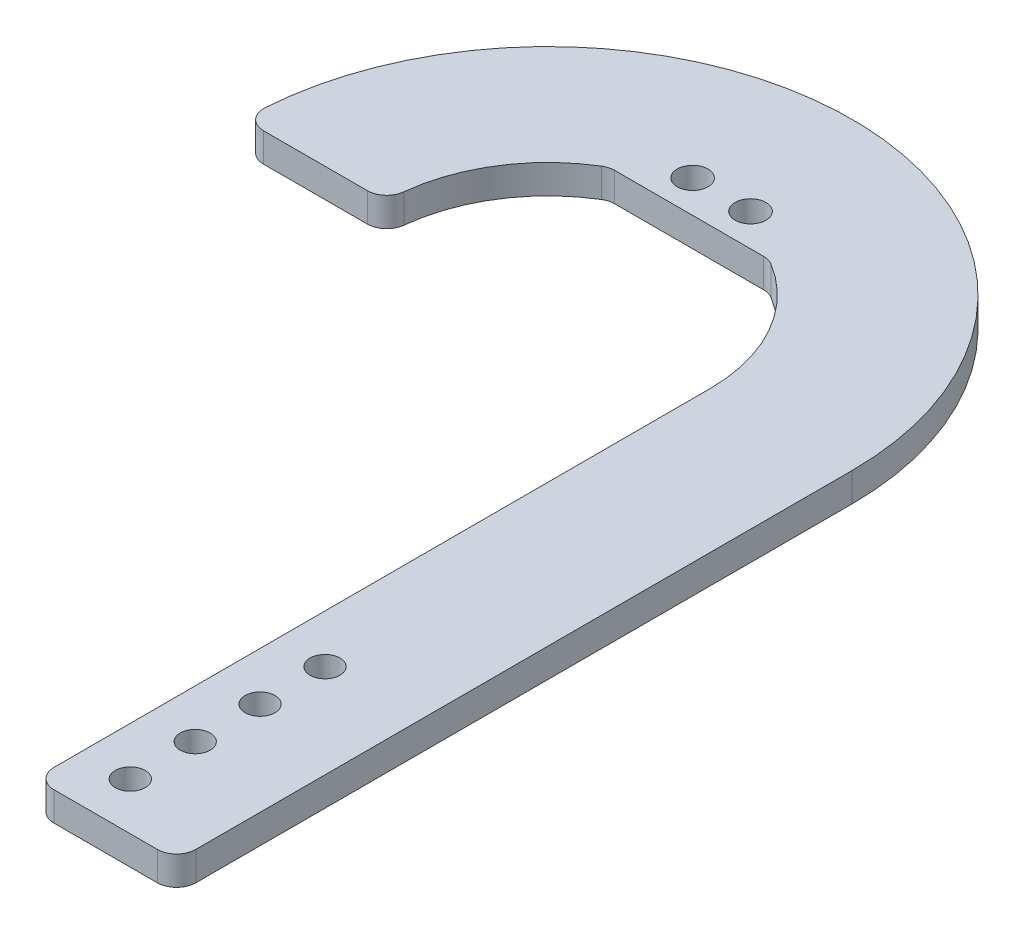
ISO-10303-21;
HEADER;
FILE_DESCRIPTION(('STEP AP214'),'2;1');
FILE_NAME('part.step','',(''),(''),'','','');
FILE_SCHEMA(('AUTOMOTIVE_DESIGN { 1 0 10303 214 1 1 1 1 }'));
ENDSEC;
DATA;
#1=APPLICATION_CONTEXT('core data for automotive mechanical design processes');
#2=APPLICATION_PROTOCOL_DEFINITION('international standard','automotive_design',2000,#1);
#3=PRODUCT_CONTEXT('',#1,'mechanical');
#4=PRODUCT('Part','Part','',(#3));
#5=PRODUCT_RELATED_PRODUCT_CATEGORY('part','',(#4));
#6=PRODUCT_DEFINITION_FORMATION('','',#4);
#7=PRODUCT_DEFINITION_CONTEXT('part definition',#1,'design');
#8=PRODUCT_DEFINITION('design','',#6,#7);
#9=PRODUCT_DEFINITION_SHAPE('','',#8);
#10=(LENGTH_UNIT() NAMED_UNIT(*) SI_UNIT(.MILLI.,.METRE.));
#11=(NAMED_UNIT(*) PLANE_ANGLE_UNIT() SI_UNIT($,.RADIAN.));
#12=(NAMED_UNIT(*) SI_UNIT($,.STERADIAN.) SOLID_ANGLE_UNIT());
#13=UNCERTAINTY_MEASURE_WITH_UNIT(LENGTH_MEASURE(1.E-05),#10,'distance_accuracy_value','');
#14=(GEOMETRIC_REPRESENTATION_CONTEXT(3) GLOBAL_UNCERTAINTY_ASSIGNED_CONTEXT((#13)) GLOBAL_UNIT_ASSIGNED_CONTEXT((#10,
#11,#12)) REPRESENTATION_CONTEXT('',''));
#15=CARTESIAN_POINT('',(0.,0.,0.));
#16=DIRECTION('',(0.,0.,1.));
#17=DIRECTION('',(1.,0.,0.));
#18=AXIS2_PLACEMENT_3D('',#15,#16,#17);
#19=CARTESIAN_POINT('',(0.,3.,0.));
#20=DIRECTION('',(0.,-1.,0.));
#21=DIRECTION('',(0.,0.,-1.));
#22=AXIS2_PLACEMENT_3D('',#19,#20,#21);
#23=CYLINDRICAL_SURFACE('',#22,16.8134);
#24=CARTESIAN_POINT('',(0.,0.,0.));
#25=DIRECTION('',(0.,1.,0.));
#26=DIRECTION('',(0.,0.,1.));
#27=AXIS2_PLACEMENT_3D('',#24,#25,#26);
#28=CIRCLE('',#27,16.8134);
#29=CARTESIAN_POINT('',(-8.77269581239082,0.,-14.3432990536787));
#30=VERTEX_POINT('',#29);
#31=CARTESIAN_POINT('',(-16.7181240671271,0.,-1.78738558686893));
#32=VERTEX_POINT('',#31);
#33=EDGE_CURVE('E254',#30,#32,#28,.T.);
#34=ORIENTED_EDGE('',*,*,#33,.F.);
#35=DIRECTION('',(0.,-1.,0.));
#36=VECTOR('',#35,1.);
#37=CARTESIAN_POINT('',(-8.77269581239082,3.,-14.3432990536787));
#38=LINE('',#37,#36);
#39=CARTESIAN_POINT('',(-8.77269581239082,3.,-14.3432990536787));
#40=VERTEX_POINT('',#39);
#41=EDGE_CURVE('E204',#30,#40,#38,.F.);
#42=ORIENTED_EDGE('',*,*,#41,.T.);
#43=CARTESIAN_POINT('',(0.,3.,0.));
#44=DIRECTION('',(0.,1.,0.));
#45=DIRECTION('',(0.,0.,1.));
#46=AXIS2_PLACEMENT_3D('',#43,#44,#45);
#47=CIRCLE('',#46,16.8134);
#48=CARTESIAN_POINT('',(-16.7181240671271,3.,-1.78738558686893));
#49=VERTEX_POINT('',#48);
#50=EDGE_CURVE('E173',#40,#49,#47,.T.);
#51=ORIENTED_EDGE('',*,*,#50,.T.);
#52=DIRECTION('',(0.,-1.,0.));
#53=VECTOR('',#52,1.);
#54=CARTESIAN_POINT('',(-16.7181240671271,3.,-1.78738558686893));
#55=LINE('',#54,#53);
#56=EDGE_CURVE('E202',#49,#32,#55,.T.);
#57=ORIENTED_EDGE('',*,*,#56,.T.);
#58=EDGE_LOOP('',(#34,#42,#51,#57));
#59=FACE_BOUND('',#58,.T.);
#60=ADVANCED_FACE('F41',(#59),#23,.F.);
#61=CARTESIAN_POINT('',(0.,3.,-14.6371243295089));
#62=DIRECTION('',(0.,0.,-1.));
#63=DIRECTION('',(-1.,0.,0.));
#64=AXIS2_PLACEMENT_3D('',#61,#62,#63);
#65=PLANE('',#64);
#66=DIRECTION('',(1.,0.,0.));
#67=VECTOR('',#66,1.);
#68=CARTESIAN_POINT('',(0.,3.,-14.6371243295089));
#69=LINE('',#68,#67);
#70=CARTESIAN_POINT('',(-7.72915960765046,3.,-14.6371243295089));
#71=VERTEX_POINT('',#70);
#72=CARTESIAN_POINT('',(7.72915960765046,3.,-14.6371243295089));
#73=VERTEX_POINT('',#72);
#74=EDGE_CURVE('E171',#71,#73,#69,.T.);
#75=ORIENTED_EDGE('',*,*,#74,.F.);
#76=DIRECTION('',(0.,-1.,0.));
#77=VECTOR('',#76,1.);
#78=CARTESIAN_POINT('',(-7.72915960765046,3.,-14.6371243295089));
#79=LINE('',#78,#77);
#80=CARTESIAN_POINT('',(-7.72915960765046,0.,-14.6371243295089));
#81=VERTEX_POINT('',#80);
#82=EDGE_CURVE('E199',#71,#81,#79,.T.);
#83=ORIENTED_EDGE('',*,*,#82,.T.);
#84=DIRECTION('',(1.,0.,0.));
#85=VECTOR('',#84,1.);
#86=CARTESIAN_POINT('',(0.,0.,-14.6371243295089));
#87=LINE('',#86,#85);
#88=CARTESIAN_POINT('',(7.72915960765046,0.,-14.6371243295089));
#89=VERTEX_POINT('',#88);
#90=EDGE_CURVE('E247',#81,#89,#87,.T.);
#91=ORIENTED_EDGE('',*,*,#90,.T.);
#92=DIRECTION('',(0.,-1.,0.));
#93=VECTOR('',#92,1.);
#94=CARTESIAN_POINT('',(7.72915960765046,3.,-14.6371243295089));
#95=LINE('',#94,#93);
#96=EDGE_CURVE('E163',#89,#73,#95,.F.);
#97=ORIENTED_EDGE('',*,*,#96,.T.);
#98=EDGE_LOOP('',(#75,#83,#91,#97));
#99=FACE_BOUND('',#98,.T.);
#100=ADVANCED_FACE('F252',(#99),#65,.F.);
#101=CARTESIAN_POINT('',(16.8134,3.,0.));
#102=VERTEX_POINT('',#101);
#103=CARTESIAN_POINT('',(8.77269581239082,3.,-14.3432990536787));
#104=VERTEX_POINT('',#103);
#105=EDGE_CURVE('E154',#102,#104,#47,.T.);
#106=ORIENTED_EDGE('',*,*,#105,.T.);
#107=DIRECTION('',(0.,-1.,0.));
#108=VECTOR('',#107,1.);
#109=CARTESIAN_POINT('',(8.77269581239082,3.,-14.3432990536787));
#110=LINE('',#109,#108);
#111=CARTESIAN_POINT('',(8.77269581239082,0.,-14.3432990536787));
#112=VERTEX_POINT('',#111);
#113=EDGE_CURVE('E206',#104,#112,#110,.T.);
#114=ORIENTED_EDGE('',*,*,#113,.T.);
#115=CARTESIAN_POINT('',(16.8134,0.,0.));
#116=VERTEX_POINT('',#115);
#117=EDGE_CURVE('E162',#116,#112,#28,.T.);
#118=ORIENTED_EDGE('',*,*,#117,.F.);
#119=DIRECTION('',(0.,-1.,0.));
#120=VECTOR('',#119,1.);
#121=CARTESIAN_POINT('',(16.8134,3.,0.));
#122=LINE('',#121,#120);
#123=EDGE_CURVE('E147',#102,#116,#122,.T.);
#124=ORIENTED_EDGE('',*,*,#123,.F.);
#125=EDGE_LOOP('',(#106,#114,#118,#124));
#126=FACE_BOUND('',#125,.T.);
#127=ADVANCED_FACE('F158',(#126),#23,.F.);
#128=CARTESIAN_POINT('',(16.8134,3.,0.));
#129=DIRECTION('',(-1.,0.,0.));
#130=DIRECTION('',(0.,0.,1.));
#131=AXIS2_PLACEMENT_3D('',#128,#129,#130);
#132=PLANE('',#131);
#133=DIRECTION('',(0.,0.,-1.));
#134=VECTOR('',#133,1.);
#135=CARTESIAN_POINT('',(16.8134,0.,0.));
#136=LINE('',#135,#134);
#137=CARTESIAN_POINT('',(16.8134,0.,68.));
#138=VERTEX_POINT('',#137);
#139=EDGE_CURVE('E415',#138,#116,#136,.T.);
#140=ORIENTED_EDGE('',*,*,#139,.F.);
#141=DIRECTION('',(0.,-1.,0.));
#142=VECTOR('',#141,1.);
#143=CARTESIAN_POINT('',(16.8134,3.,68.));
#144=LINE('',#143,#142);
#145=CARTESIAN_POINT('',(16.8134,3.,68.));
#146=VERTEX_POINT('',#145);
#147=EDGE_CURVE('E150',#138,#146,#144,.F.);
#148=ORIENTED_EDGE('',*,*,#147,.T.);
#149=DIRECTION('',(0.,0.,-1.));
#150=VECTOR('',#149,1.);
#151=CARTESIAN_POINT('',(16.8134,3.,0.));
#152=LINE('',#151,#150);
#153=EDGE_CURVE('E143',#146,#102,#152,.T.);
#154=ORIENTED_EDGE('',*,*,#153,.T.);
#155=ORIENTED_EDGE('',*,*,#123,.T.);
#156=EDGE_LOOP('',(#140,#148,#154,#155));
#157=FACE_BOUND('',#156,.T.);
#158=ADVANCED_FACE('F146',(#157),#132,.T.);
#159=CARTESIAN_POINT('',(0.,3.,70.));
#160=DIRECTION('',(0.,0.,-1.));
#161=DIRECTION('',(-1.,0.,0.));
#162=AXIS2_PLACEMENT_3D('',#159,#160,#161);
#163=PLANE('',#162);
#164=DIRECTION('',(1.,0.,0.));
#165=VECTOR('',#164,1.);
#166=CARTESIAN_POINT('',(0.,0.,70.));
#167=LINE('',#166,#165);
#168=CARTESIAN_POINT('',(18.8134,0.,70.));
#169=VERTEX_POINT('',#168);
#170=CARTESIAN_POINT('',(29.5228,0.,70.));
#171=VERTEX_POINT('',#170);
#172=EDGE_CURVE('E412',#169,#171,#167,.T.);
#173=ORIENTED_EDGE('',*,*,#172,.T.);
#174=DIRECTION('',(0.,-1.,0.));
#175=VECTOR('',#174,1.);
#176=CARTESIAN_POINT('',(29.5228,3.,70.));
#177=LINE('',#176,#175);
#178=CARTESIAN_POINT('',(29.5228,3.,70.));
#179=VERTEX_POINT('',#178);
#180=EDGE_CURVE('E222',#171,#179,#177,.F.);
#181=ORIENTED_EDGE('',*,*,#180,.T.);
#182=DIRECTION('',(1.,0.,0.));
#183=VECTOR('',#182,1.);
#184=CARTESIAN_POINT('',(0.,3.,70.));
#185=LINE('',#184,#183);
#186=CARTESIAN_POINT('',(18.8134,3.,70.));
#187=VERTEX_POINT('',#186);
#188=EDGE_CURVE('E153',#187,#179,#185,.T.);
#189=ORIENTED_EDGE('',*,*,#188,.F.);
#190=DIRECTION('',(0.,-1.,0.));
#191=VECTOR('',#190,1.);
#192=CARTESIAN_POINT('',(18.8134,0.,70.));
#193=LINE('',#192,#191);
#194=EDGE_CURVE('E219',#187,#169,#193,.T.);
#195=ORIENTED_EDGE('',*,*,#194,.T.);
#196=EDGE_LOOP('',(#173,#181,#189,#195));
#197=FACE_BOUND('',#196,.T.);
#198=ADVANCED_FACE('F283',(#197),#163,.F.);
#199=CARTESIAN_POINT('',(31.5228,3.,0.));
#200=DIRECTION('',(1.,0.,0.));
#201=DIRECTION('',(0.,0.,-1.));
#202=AXIS2_PLACEMENT_3D('',#199,#200,#201);
#203=PLANE('',#202);
#204=DIRECTION('',(0.,0.,1.));
#205=VECTOR('',#204,1.);
#206=CARTESIAN_POINT('',(31.5228,3.,0.));
#207=LINE('',#206,#205);
#208=CARTESIAN_POINT('',(31.5228,3.,0.));
#209=VERTEX_POINT('',#208);
#210=CARTESIAN_POINT('',(31.5228,3.,68.));
#211=VERTEX_POINT('',#210);
#212=EDGE_CURVE('E438',#209,#211,#207,.T.);
#213=ORIENTED_EDGE('',*,*,#212,.T.);
#214=DIRECTION('',(0.,-1.,0.));
#215=VECTOR('',#214,1.);
#216=CARTESIAN_POINT('',(31.5228,0.,68.));
#217=LINE('',#216,#215);
#218=CARTESIAN_POINT('',(31.5228,0.,68.));
#219=VERTEX_POINT('',#218);
#220=EDGE_CURVE('E208',#211,#219,#217,.T.);
#221=ORIENTED_EDGE('',*,*,#220,.T.);
#222=DIRECTION('',(0.,0.,1.));
#223=VECTOR('',#222,1.);
#224=CARTESIAN_POINT('',(31.5228,0.,0.));
#225=LINE('',#224,#223);
#226=CARTESIAN_POINT('',(31.5228,0.,0.));
#227=VERTEX_POINT('',#226);
#228=EDGE_CURVE('E396',#227,#219,#225,.T.);
#229=ORIENTED_EDGE('',*,*,#228,.F.);
#230=DIRECTION('',(0.,-1.,0.));
#231=VECTOR('',#230,1.);
#232=CARTESIAN_POINT('',(31.5228,3.,0.));
#233=LINE('',#232,#231);
#234=EDGE_CURVE('E164',#209,#227,#233,.T.);
#235=ORIENTED_EDGE('',*,*,#234,.F.);
#236=EDGE_LOOP('',(#213,#221,#229,#235));
#237=FACE_BOUND('',#236,.T.);
#238=ADVANCED_FACE('F287',(#237),#203,.T.);
#239=CARTESIAN_POINT('',(0.,3.,0.));
#240=DIRECTION('',(0.,-1.,0.));
#241=DIRECTION('',(0.,0.,-1.));
#242=AXIS2_PLACEMENT_3D('',#239,#240,#241);
#243=CYLINDRICAL_SURFACE('',#242,31.5228);
#244=CARTESIAN_POINT('',(0.,0.,0.));
#245=DIRECTION('',(0.,1.,0.));
#246=DIRECTION('',(0.,0.,1.));
#247=AXIS2_PLACEMENT_3D('',#244,#245,#246);
#248=CIRCLE('',#247,31.5228);
#249=CARTESIAN_POINT('',(-31.4503832836761,0.,-2.13548850380045));
#250=VERTEX_POINT('',#249);
#251=EDGE_CURVE('E391',#227,#250,#248,.T.);
#252=ORIENTED_EDGE('',*,*,#251,.T.);
#253=DIRECTION('',(0.,-1.,0.));
#254=VECTOR('',#253,1.);
#255=CARTESIAN_POINT('',(-31.4503832836761,3.,-2.13548850380045));
#256=LINE('',#255,#254);
#257=CARTESIAN_POINT('',(-31.4503832836761,3.,-2.13548850380045));
#258=VERTEX_POINT('',#257);
#259=EDGE_CURVE('E236',#250,#258,#256,.F.);
#260=ORIENTED_EDGE('',*,*,#259,.T.);
#261=CARTESIAN_POINT('',(0.,3.,0.));
#262=DIRECTION('',(0.,1.,0.));
#263=DIRECTION('',(0.,0.,1.));
#264=AXIS2_PLACEMENT_3D('',#261,#262,#263);
#265=CIRCLE('',#264,31.5228);
#266=EDGE_CURVE('E436',#209,#258,#265,.T.);
#267=ORIENTED_EDGE('',*,*,#266,.F.);
#268=ORIENTED_EDGE('',*,*,#234,.T.);
#269=EDGE_LOOP('',(#252,#260,#267,#268));
#270=FACE_BOUND('',#269,.T.);
#271=ADVANCED_FACE('F293',(#270),#243,.T.);
#272=CARTESIAN_POINT('',(21.8134,3.,58.3629));
#273=DIRECTION('',(0.,-1.,0.));
#274=DIRECTION('',(0.,0.,-1.));
#275=AXIS2_PLACEMENT_3D('',#272,#273,#274);
#276=CYLINDRICAL_SURFACE('',#275,1.55);
#277=CARTESIAN_POINT('',(21.8134,3.,58.3629));
#278=DIRECTION('',(0.,1.,0.));
#279=DIRECTION('',(0.,0.,1.));
#280=AXIS2_PLACEMENT_3D('',#277,#278,#279);
#281=CIRCLE('',#280,1.55);
#282=CARTESIAN_POINT('',(21.8134,3.,59.9129));
#283=VERTEX_POINT('',#282);
#284=EDGE_CURVE('E423',#283,#283,#281,.T.);
#285=ORIENTED_EDGE('',*,*,#284,.T.);
#286=EDGE_LOOP('',(#285));
#287=FACE_BOUND('',#286,.T.);
#288=CARTESIAN_POINT('',(21.8134,0.,58.3629));
#289=DIRECTION('',(0.,1.,0.));
#290=DIRECTION('',(0.,0.,1.));
#291=AXIS2_PLACEMENT_3D('',#288,#289,#290);
#292=CIRCLE('',#291,1.55);
#293=CARTESIAN_POINT('',(21.8134,0.,59.9129));
#294=VERTEX_POINT('',#293);
#295=EDGE_CURVE('E187',#294,#294,#292,.T.);
#296=ORIENTED_EDGE('',*,*,#295,.F.);
#297=EDGE_LOOP('',(#296));
#298=FACE_BOUND('',#297,.T.);
#299=ADVANCED_FACE('F297',(#287,#298),#276,.F.);
#300=CARTESIAN_POINT('',(-3.,3.,-18.));
#301=DIRECTION('',(0.,-1.,0.));
#302=DIRECTION('',(0.,0.,-1.));
#303=AXIS2_PLACEMENT_3D('',#300,#301,#302);
#304=CYLINDRICAL_SURFACE('',#303,1.6);
#305=CARTESIAN_POINT('',(-3.,3.,-18.));
#306=DIRECTION('',(0.,1.,0.));
#307=DIRECTION('',(0.,0.,1.));
#308=AXIS2_PLACEMENT_3D('',#305,#306,#307);
#309=CIRCLE('',#308,1.6);
#310=CARTESIAN_POINT('',(-3.,3.,-16.4));
#311=VERTEX_POINT('',#310);
#312=EDGE_CURVE('E426',#311,#311,#309,.T.);
#313=ORIENTED_EDGE('',*,*,#312,.T.);
#314=EDGE_LOOP('',(#313));
#315=FACE_BOUND('',#314,.T.);
#316=CARTESIAN_POINT('',(-3.,0.,-18.));
#317=DIRECTION('',(0.,1.,0.));
#318=DIRECTION('',(0.,0.,1.));
#319=AXIS2_PLACEMENT_3D('',#316,#317,#318);
#320=CIRCLE('',#319,1.6);
#321=CARTESIAN_POINT('',(-3.,0.,-16.4));
#322=VERTEX_POINT('',#321);
#323=EDGE_CURVE('E192',#322,#322,#320,.T.);
#324=ORIENTED_EDGE('',*,*,#323,.F.);
#325=EDGE_LOOP('',(#324));
#326=FACE_BOUND('',#325,.T.);
#327=ADVANCED_FACE('F310',(#315,#326),#304,.F.);
#328=CARTESIAN_POINT('',(21.8134,3.,51.6371));
#329=DIRECTION('',(0.,-1.,0.));
#330=DIRECTION('',(0.,0.,-1.));
#331=AXIS2_PLACEMENT_3D('',#328,#329,#330);
#332=CYLINDRICAL_SURFACE('',#331,1.55);
#333=CARTESIAN_POINT('',(21.8134,3.,51.6371));
#334=DIRECTION('',(0.,1.,0.));
#335=DIRECTION('',(0.,0.,1.));
#336=AXIS2_PLACEMENT_3D('',#333,#334,#335);
#337=CIRCLE('',#336,1.55);
#338=CARTESIAN_POINT('',(21.8134,3.,53.1871));
#339=VERTEX_POINT('',#338);
#340=EDGE_CURVE('E429',#339,#339,#337,.T.);
#341=ORIENTED_EDGE('',*,*,#340,.T.);
#342=EDGE_LOOP('',(#341));
#343=FACE_BOUND('',#342,.T.);
#344=CARTESIAN_POINT('',(21.8134,0.,51.6371));
#345=DIRECTION('',(0.,1.,0.));
#346=DIRECTION('',(0.,0.,1.));
#347=AXIS2_PLACEMENT_3D('',#344,#345,#346);
#348=CIRCLE('',#347,1.55);
#349=CARTESIAN_POINT('',(21.8134,0.,53.1871));
#350=VERTEX_POINT('',#349);
#351=EDGE_CURVE('E394',#350,#350,#348,.T.);
#352=ORIENTED_EDGE('',*,*,#351,.F.);
#353=EDGE_LOOP('',(#352));
#354=FACE_BOUND('',#353,.T.);
#355=ADVANCED_FACE('F306',(#343,#354),#332,.F.);
#356=CARTESIAN_POINT('',(21.8134,3.,44.9113));
#357=DIRECTION('',(0.,-1.,0.));
#358=DIRECTION('',(0.,0.,-1.));
#359=AXIS2_PLACEMENT_3D('',#356,#357,#358);
#360=CYLINDRICAL_SURFACE('',#359,1.55);
#361=CARTESIAN_POINT('',(21.8134,3.,44.9113));
#362=DIRECTION('',(0.,1.,0.));
#363=DIRECTION('',(0.,0.,1.));
#364=AXIS2_PLACEMENT_3D('',#361,#362,#363);
#365=CIRCLE('',#364,1.55);
#366=CARTESIAN_POINT('',(21.8134,3.,46.4613));
#367=VERTEX_POINT('',#366);
#368=EDGE_CURVE('E432',#367,#367,#365,.T.);
#369=ORIENTED_EDGE('',*,*,#368,.T.);
#370=EDGE_LOOP('',(#369));
#371=FACE_BOUND('',#370,.T.);
#372=CARTESIAN_POINT('',(21.8134,0.,44.9113));
#373=DIRECTION('',(0.,1.,0.));
#374=DIRECTION('',(0.,0.,1.));
#375=AXIS2_PLACEMENT_3D('',#372,#373,#374);
#376=CIRCLE('',#375,1.55);
#377=CARTESIAN_POINT('',(21.8134,0.,46.4613));
#378=VERTEX_POINT('',#377);
#379=EDGE_CURVE('E390',#378,#378,#376,.T.);
#380=ORIENTED_EDGE('',*,*,#379,.F.);
#381=EDGE_LOOP('',(#380));
#382=FACE_BOUND('',#381,.T.);
#383=ADVANCED_FACE('F303',(#371,#382),#360,.F.);
#384=CARTESIAN_POINT('',(0.,3.,0.));
#385=DIRECTION('',(0.,0.,-1.));
#386=DIRECTION('',(-1.,0.,0.));
#387=AXIS2_PLACEMENT_3D('',#384,#385,#386);
#388=PLANE('',#387);
#389=DIRECTION('',(1.,0.,0.));
#390=VECTOR('',#389,1.);
#391=CARTESIAN_POINT('',(0.,0.,0.));
#392=LINE('',#391,#390);
#393=CARTESIAN_POINT('',(-29.4549778448397,0.,0.));
#394=VERTEX_POINT('',#393);
#395=CARTESIAN_POINT('',(-18.7067907338485,0.,0.));
#396=VERTEX_POINT('',#395);
#397=EDGE_CURVE('E385',#394,#396,#392,.T.);
#398=ORIENTED_EDGE('',*,*,#397,.T.);
#399=DIRECTION('',(0.,1.,0.));
#400=VECTOR('',#399,1.);
#401=CARTESIAN_POINT('',(-18.7067907338485,3.,0.));
#402=LINE('',#401,#400);
#403=CARTESIAN_POINT('',(-18.7067907338485,3.,0.));
#404=VERTEX_POINT('',#403);
#405=EDGE_CURVE('E56',#396,#404,#402,.T.);
#406=ORIENTED_EDGE('',*,*,#405,.T.);
#407=DIRECTION('',(1.,0.,0.));
#408=VECTOR('',#407,1.);
#409=CARTESIAN_POINT('',(0.,3.,0.));
#410=LINE('',#409,#408);
#411=CARTESIAN_POINT('',(-29.4549778448397,3.,0.));
#412=VERTEX_POINT('',#411);
#413=EDGE_CURVE('E386',#412,#404,#410,.T.);
#414=ORIENTED_EDGE('',*,*,#413,.F.);
#415=DIRECTION('',(0.,-1.,0.));
#416=VECTOR('',#415,1.);
#417=CARTESIAN_POINT('',(-29.4549778448397,3.,0.));
#418=LINE('',#417,#416);
#419=EDGE_CURVE('E232',#412,#394,#418,.T.);
#420=ORIENTED_EDGE('',*,*,#419,.T.);
#421=EDGE_LOOP('',(#398,#406,#414,#420));
#422=FACE_BOUND('',#421,.T.);
#423=ADVANCED_FACE('F299',(#422),#388,.F.);
#424=CARTESIAN_POINT('',(3.,3.,-18.));
#425=DIRECTION('',(0.,-1.,0.));
#426=DIRECTION('',(0.,0.,-1.));
#427=AXIS2_PLACEMENT_3D('',#424,#425,#426);
#428=CYLINDRICAL_SURFACE('',#427,1.6);
#429=CARTESIAN_POINT('',(3.,3.,-18.));
#430=DIRECTION('',(0.,1.,0.));
#431=DIRECTION('',(0.,0.,1.));
#432=AXIS2_PLACEMENT_3D('',#429,#430,#431);
#433=CIRCLE('',#432,1.6);
#434=CARTESIAN_POINT('',(3.,3.,-16.4));
#435=VERTEX_POINT('',#434);
#436=EDGE_CURVE('E177',#435,#435,#433,.T.);
#437=ORIENTED_EDGE('',*,*,#436,.T.);
#438=EDGE_LOOP('',(#437));
#439=FACE_BOUND('',#438,.T.);
#440=CARTESIAN_POINT('',(3.,0.,-18.));
#441=DIRECTION('',(0.,1.,0.));
#442=DIRECTION('',(0.,0.,1.));
#443=AXIS2_PLACEMENT_3D('',#440,#441,#442);
#444=CIRCLE('',#443,1.6);
#445=CARTESIAN_POINT('',(3.,0.,-16.4));
#446=VERTEX_POINT('',#445);
#447=EDGE_CURVE('E418',#446,#446,#444,.T.);
#448=ORIENTED_EDGE('',*,*,#447,.F.);
#449=EDGE_LOOP('',(#448));
#450=FACE_BOUND('',#449,.T.);
#451=ADVANCED_FACE('F302',(#439,#450),#428,.F.);
#452=CARTESIAN_POINT('',(21.8134,3.,65.0887));
#453=DIRECTION('',(0.,-1.,0.));
#454=DIRECTION('',(0.,0.,-1.));
#455=AXIS2_PLACEMENT_3D('',#452,#453,#454);
#456=CYLINDRICAL_SURFACE('',#455,1.55);
#457=CARTESIAN_POINT('',(21.8134,3.,65.0887));
#458=DIRECTION('',(0.,1.,0.));
#459=DIRECTION('',(0.,0.,1.));
#460=AXIS2_PLACEMENT_3D('',#457,#458,#459);
#461=CIRCLE('',#460,1.55);
#462=CARTESIAN_POINT('',(21.8134,3.,66.6387));
#463=VERTEX_POINT('',#462);
#464=EDGE_CURVE('E196',#463,#463,#461,.T.);
#465=ORIENTED_EDGE('',*,*,#464,.T.);
#466=EDGE_LOOP('',(#465));
#467=FACE_BOUND('',#466,.T.);
#468=CARTESIAN_POINT('',(21.8134,0.,65.0887));
#469=DIRECTION('',(0.,1.,0.));
#470=DIRECTION('',(0.,0.,1.));
#471=AXIS2_PLACEMENT_3D('',#468,#469,#470);
#472=CIRCLE('',#471,1.55);
#473=CARTESIAN_POINT('',(21.8134,0.,66.6387));
#474=VERTEX_POINT('',#473);
#475=EDGE_CURVE('E183',#474,#474,#472,.T.);
#476=ORIENTED_EDGE('',*,*,#475,.F.);
#477=EDGE_LOOP('',(#476));
#478=FACE_BOUND('',#477,.T.);
#479=ADVANCED_FACE('F318',(#467,#478),#456,.F.);
#480=CARTESIAN_POINT('',(0.,3.,0.));
#481=DIRECTION('',(0.,1.,0.));
#482=DIRECTION('',(0.,0.,1.));
#483=AXIS2_PLACEMENT_3D('',#480,#481,#482);
#484=PLANE('',#483);
#485=ORIENTED_EDGE('',*,*,#436,.F.);
#486=EDGE_LOOP('',(#485));
#487=FACE_BOUND('',#486,.T.);
#488=ORIENTED_EDGE('',*,*,#188,.T.);
#489=CARTESIAN_POINT('',(29.5228,3.,68.));
#490=DIRECTION('',(0.,1.,0.));
#491=DIRECTION('',(0.,0.,1.));
#492=AXIS2_PLACEMENT_3D('',#489,#490,#491);
#493=CIRCLE('',#492,2.);
#494=EDGE_CURVE('E229',#179,#211,#493,.T.);
#495=ORIENTED_EDGE('',*,*,#494,.T.);
#496=ORIENTED_EDGE('',*,*,#212,.F.);
#497=ORIENTED_EDGE('',*,*,#266,.T.);
#498=CARTESIAN_POINT('',(-29.4549778448397,3.,-2.));
#499=DIRECTION('',(0.,1.,0.));
#500=DIRECTION('',(0.,0.,1.));
#501=AXIS2_PLACEMENT_3D('',#498,#499,#500);
#502=CIRCLE('',#501,2.);
#503=EDGE_CURVE('E63',#258,#412,#502,.T.);
#504=ORIENTED_EDGE('',*,*,#503,.T.);
#505=ORIENTED_EDGE('',*,*,#413,.T.);
#506=CARTESIAN_POINT('',(-18.7067907338485,3.,-2.));
#507=DIRECTION('',(0.,1.,0.));
#508=DIRECTION('',(0.,0.,1.));
#509=AXIS2_PLACEMENT_3D('',#506,#507,#508);
#510=CIRCLE('',#509,2.);
#511=EDGE_CURVE('E225',#404,#49,#510,.T.);
#512=ORIENTED_EDGE('',*,*,#511,.T.);
#513=ORIENTED_EDGE('',*,*,#50,.F.);
#514=CARTESIAN_POINT('',(-7.72915960765046,3.,-12.6371243295089));
#515=DIRECTION('',(0.,1.,0.));
#516=DIRECTION('',(0.,0.,1.));
#517=AXIS2_PLACEMENT_3D('',#514,#515,#516);
#518=CIRCLE('',#517,2.);
#519=EDGE_CURVE('E240',#40,#71,#518,.F.);
#520=ORIENTED_EDGE('',*,*,#519,.T.);
#521=ORIENTED_EDGE('',*,*,#74,.T.);
#522=CARTESIAN_POINT('',(7.72915960765046,3.,-12.6371243295089));
#523=DIRECTION('',(0.,1.,0.));
#524=DIRECTION('',(0.,0.,1.));
#525=AXIS2_PLACEMENT_3D('',#522,#523,#524);
#526=CIRCLE('',#525,2.);
#527=EDGE_CURVE('E11',#73,#104,#526,.F.);
#528=ORIENTED_EDGE('',*,*,#527,.T.);
#529=ORIENTED_EDGE('',*,*,#105,.F.);
#530=ORIENTED_EDGE('',*,*,#153,.F.);
#531=CARTESIAN_POINT('',(18.8134,3.,68.));
#532=DIRECTION('',(0.,1.,0.));
#533=DIRECTION('',(0.,0.,1.));
#534=AXIS2_PLACEMENT_3D('',#531,#532,#533);
#535=CIRCLE('',#534,2.);
#536=EDGE_CURVE('E227',#146,#187,#535,.T.);
#537=ORIENTED_EDGE('',*,*,#536,.T.);
#538=EDGE_LOOP('',(#488,#495,#496,#497,#504,#505,#512,#513,#520,#521,#528,#529,#530,#537));
#539=FACE_BOUND('',#538,.T.);
#540=ORIENTED_EDGE('',*,*,#368,.F.);
#541=EDGE_LOOP('',(#540));
#542=FACE_BOUND('',#541,.T.);
#543=ORIENTED_EDGE('',*,*,#340,.F.);
#544=EDGE_LOOP('',(#543));
#545=FACE_BOUND('',#544,.T.);
#546=ORIENTED_EDGE('',*,*,#312,.F.);
#547=EDGE_LOOP('',(#546));
#548=FACE_BOUND('',#547,.T.);
#549=ORIENTED_EDGE('',*,*,#284,.F.);
#550=EDGE_LOOP('',(#549));
#551=FACE_BOUND('',#550,.T.);
#552=ORIENTED_EDGE('',*,*,#464,.F.);
#553=EDGE_LOOP('',(#552));
#554=FACE_BOUND('',#553,.T.);
#555=ADVANCED_FACE('F167',(#487,#539,#542,#545,#548,#551,#554),#484,.T.);
#556=CARTESIAN_POINT('',(0.,0.,0.));
#557=DIRECTION('',(0.,1.,0.));
#558=DIRECTION('',(0.,0.,1.));
#559=AXIS2_PLACEMENT_3D('',#556,#557,#558);
#560=PLANE('',#559);
#561=ORIENTED_EDGE('',*,*,#447,.T.);
#562=EDGE_LOOP('',(#561));
#563=FACE_BOUND('',#562,.T.);
#564=ORIENTED_EDGE('',*,*,#228,.T.);
#565=CARTESIAN_POINT('',(29.5228,0.,68.));
#566=DIRECTION('',(0.,1.,0.));
#567=DIRECTION('',(0.,0.,1.));
#568=AXIS2_PLACEMENT_3D('',#565,#566,#567);
#569=CIRCLE('',#568,2.);
#570=EDGE_CURVE('E217',#219,#171,#569,.F.);
#571=ORIENTED_EDGE('',*,*,#570,.T.);
#572=ORIENTED_EDGE('',*,*,#172,.F.);
#573=CARTESIAN_POINT('',(18.8134,0.,68.));
#574=DIRECTION('',(0.,1.,0.));
#575=DIRECTION('',(0.,0.,1.));
#576=AXIS2_PLACEMENT_3D('',#573,#574,#575);
#577=CIRCLE('',#576,2.);
#578=EDGE_CURVE('E215',#169,#138,#577,.F.);
#579=ORIENTED_EDGE('',*,*,#578,.T.);
#580=ORIENTED_EDGE('',*,*,#139,.T.);
#581=ORIENTED_EDGE('',*,*,#117,.T.);
#582=CARTESIAN_POINT('',(7.72915960765046,0.,-12.6371243295089));
#583=DIRECTION('',(0.,1.,0.));
#584=DIRECTION('',(0.,0.,1.));
#585=AXIS2_PLACEMENT_3D('',#582,#583,#584);
#586=CIRCLE('',#585,2.);
#587=EDGE_CURVE('E49',#112,#89,#586,.T.);
#588=ORIENTED_EDGE('',*,*,#587,.T.);
#589=ORIENTED_EDGE('',*,*,#90,.F.);
#590=CARTESIAN_POINT('',(-7.72915960765046,0.,-12.6371243295089));
#591=DIRECTION('',(0.,1.,0.));
#592=DIRECTION('',(0.,0.,1.));
#593=AXIS2_PLACEMENT_3D('',#590,#591,#592);
#594=CIRCLE('',#593,2.);
#595=EDGE_CURVE('E238',#81,#30,#594,.T.);
#596=ORIENTED_EDGE('',*,*,#595,.T.);
#597=ORIENTED_EDGE('',*,*,#33,.T.);
#598=CARTESIAN_POINT('',(-18.7067907338485,0.,-2.));
#599=DIRECTION('',(0.,1.,0.));
#600=DIRECTION('',(0.,0.,1.));
#601=AXIS2_PLACEMENT_3D('',#598,#599,#600);
#602=CIRCLE('',#601,2.);
#603=EDGE_CURVE('E213',#32,#396,#602,.F.);
#604=ORIENTED_EDGE('',*,*,#603,.T.);
#605=ORIENTED_EDGE('',*,*,#397,.F.);
#606=CARTESIAN_POINT('',(-29.4549778448397,0.,-2.));
#607=DIRECTION('',(0.,1.,0.));
#608=DIRECTION('',(0.,0.,1.));
#609=AXIS2_PLACEMENT_3D('',#606,#607,#608);
#610=CIRCLE('',#609,2.);
#611=EDGE_CURVE('E211',#394,#250,#610,.F.);
#612=ORIENTED_EDGE('',*,*,#611,.T.);
#613=ORIENTED_EDGE('',*,*,#251,.F.);
#614=EDGE_LOOP('',(#564,#571,#572,#579,#580,#581,#588,#589,#596,#597,#604,#605,#612,#613));
#615=FACE_BOUND('',#614,.T.);
#616=ORIENTED_EDGE('',*,*,#379,.T.);
#617=EDGE_LOOP('',(#616));
#618=FACE_BOUND('',#617,.T.);
#619=ORIENTED_EDGE('',*,*,#351,.T.);
#620=EDGE_LOOP('',(#619));
#621=FACE_BOUND('',#620,.T.);
#622=ORIENTED_EDGE('',*,*,#323,.T.);
#623=EDGE_LOOP('',(#622));
#624=FACE_BOUND('',#623,.T.);
#625=ORIENTED_EDGE('',*,*,#295,.T.);
#626=EDGE_LOOP('',(#625));
#627=FACE_BOUND('',#626,.T.);
#628=ORIENTED_EDGE('',*,*,#475,.T.);
#629=EDGE_LOOP('',(#628));
#630=FACE_BOUND('',#629,.T.);
#631=ADVANCED_FACE('F245',(#563,#615,#618,#621,#624,#627,#630),#560,.F.);
#632=CARTESIAN_POINT('',(-7.72915960765046,3.,-12.6371243295089));
#633=DIRECTION('',(0.,-1.,0.));
#634=DIRECTION('',(0.,0.,-1.));
#635=AXIS2_PLACEMENT_3D('',#632,#633,#634);
#636=CYLINDRICAL_SURFACE('',#635,2.);
#637=ORIENTED_EDGE('',*,*,#519,.F.);
#638=ORIENTED_EDGE('',*,*,#41,.F.);
#639=ORIENTED_EDGE('',*,*,#595,.F.);
#640=ORIENTED_EDGE('',*,*,#82,.F.);
#641=EDGE_LOOP('',(#637,#638,#639,#640));
#642=FACE_BOUND('',#641,.T.);
#643=ADVANCED_FACE('F259',(#642),#636,.F.);
#644=CARTESIAN_POINT('',(7.72915960765046,3.,-12.6371243295089));
#645=DIRECTION('',(0.,-1.,0.));
#646=DIRECTION('',(0.,0.,-1.));
#647=AXIS2_PLACEMENT_3D('',#644,#645,#646);
#648=CYLINDRICAL_SURFACE('',#647,2.);
#649=ORIENTED_EDGE('',*,*,#527,.F.);
#650=ORIENTED_EDGE('',*,*,#96,.F.);
#651=ORIENTED_EDGE('',*,*,#587,.F.);
#652=ORIENTED_EDGE('',*,*,#113,.F.);
#653=EDGE_LOOP('',(#649,#650,#651,#652));
#654=FACE_BOUND('',#653,.T.);
#655=ADVANCED_FACE('F256',(#654),#648,.F.);
#656=CARTESIAN_POINT('',(29.5228,3.,68.));
#657=DIRECTION('',(0.,1.,0.));
#658=DIRECTION('',(0.,0.,1.));
#659=AXIS2_PLACEMENT_3D('',#656,#657,#658);
#660=CYLINDRICAL_SURFACE('',#659,2.);
#661=ORIENTED_EDGE('',*,*,#494,.F.);
#662=ORIENTED_EDGE('',*,*,#180,.F.);
#663=ORIENTED_EDGE('',*,*,#570,.F.);
#664=ORIENTED_EDGE('',*,*,#220,.F.);
#665=EDGE_LOOP('',(#661,#662,#663,#664));
#666=FACE_BOUND('',#665,.T.);
#667=ADVANCED_FACE('F258',(#666),#660,.T.);
#668=CARTESIAN_POINT('',(18.8134,3.,68.));
#669=DIRECTION('',(0.,1.,0.));
#670=DIRECTION('',(0.,0.,1.));
#671=AXIS2_PLACEMENT_3D('',#668,#669,#670);
#672=CYLINDRICAL_SURFACE('',#671,2.);
#673=ORIENTED_EDGE('',*,*,#536,.F.);
#674=ORIENTED_EDGE('',*,*,#147,.F.);
#675=ORIENTED_EDGE('',*,*,#578,.F.);
#676=ORIENTED_EDGE('',*,*,#194,.F.);
#677=EDGE_LOOP('',(#673,#674,#675,#676));
#678=FACE_BOUND('',#677,.T.);
#679=ADVANCED_FACE('F265',(#678),#672,.T.);
#680=CARTESIAN_POINT('',(-18.7067907338485,3.,-2.));
#681=DIRECTION('',(0.,-1.,0.));
#682=DIRECTION('',(0.,0.,-1.));
#683=AXIS2_PLACEMENT_3D('',#680,#681,#682);
#684=CYLINDRICAL_SURFACE('',#683,2.);
#685=ORIENTED_EDGE('',*,*,#511,.F.);
#686=ORIENTED_EDGE('',*,*,#405,.F.);
#687=ORIENTED_EDGE('',*,*,#603,.F.);
#688=ORIENTED_EDGE('',*,*,#56,.F.);
#689=EDGE_LOOP('',(#685,#686,#687,#688));
#690=FACE_BOUND('',#689,.T.);
#691=ADVANCED_FACE('F362',(#690),#684,.T.);
#692=CARTESIAN_POINT('',(-29.4549778448397,3.,-2.));
#693=DIRECTION('',(0.,-1.,0.));
#694=DIRECTION('',(0.,0.,-1.));
#695=AXIS2_PLACEMENT_3D('',#692,#693,#694);
#696=CYLINDRICAL_SURFACE('',#695,2.);
#697=ORIENTED_EDGE('',*,*,#503,.F.);
#698=ORIENTED_EDGE('',*,*,#259,.F.);
#699=ORIENTED_EDGE('',*,*,#611,.F.);
#700=ORIENTED_EDGE('',*,*,#419,.F.);
#701=EDGE_LOOP('',(#697,#698,#699,#700));
#702=FACE_BOUND('',#701,.T.);
#703=ADVANCED_FACE('F43',(#702),#696,.T.);
#704=CLOSED_SHELL('',(#60,#100,#127,#158,#198,#238,#271,#299,#327,#355,#383,#423,#451,#479,#555,
#631,#643,#655,#667,#679,#691,#703));
#705=MANIFOLD_SOLID_BREP('B2',#704);
#706=ADVANCED_BREP_SHAPE_REPRESENTATION('',(#18,#705),#14);
#707=SHAPE_DEFINITION_REPRESENTATION(#9,#706);
ENDSEC;
END-ISO-10303-21;
